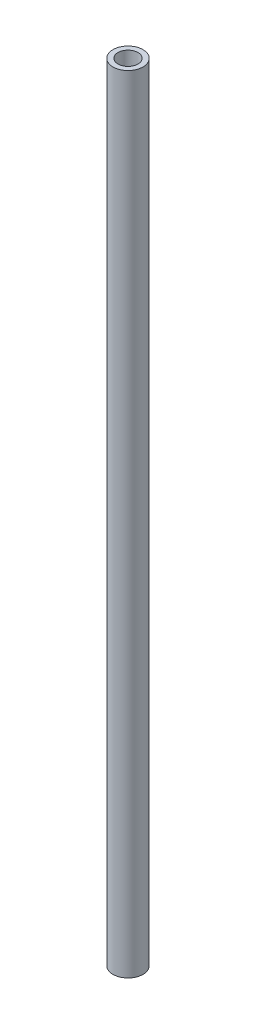
ISO-10303-21;
HEADER;
FILE_DESCRIPTION(('STEP AP214'),'2;1');
FILE_NAME('part.step','',(''),(''),'','','');
FILE_SCHEMA(('AUTOMOTIVE_DESIGN { 1 0 10303 214 1 1 1 1 }'));
ENDSEC;
DATA;
#1=APPLICATION_CONTEXT('core data for automotive mechanical design processes');
#2=APPLICATION_PROTOCOL_DEFINITION('international standard','automotive_design',2000,#1);
#3=PRODUCT_CONTEXT('',#1,'mechanical');
#4=PRODUCT('Part','Part','',(#3));
#5=PRODUCT_RELATED_PRODUCT_CATEGORY('part','',(#4));
#6=PRODUCT_DEFINITION_FORMATION('','',#4);
#7=PRODUCT_DEFINITION_CONTEXT('part definition',#1,'design');
#8=PRODUCT_DEFINITION('design','',#6,#7);
#9=PRODUCT_DEFINITION_SHAPE('','',#8);
#10=(LENGTH_UNIT() NAMED_UNIT(*) SI_UNIT(.MILLI.,.METRE.));
#11=(NAMED_UNIT(*) PLANE_ANGLE_UNIT() SI_UNIT($,.RADIAN.));
#12=(NAMED_UNIT(*) SI_UNIT($,.STERADIAN.) SOLID_ANGLE_UNIT());
#13=UNCERTAINTY_MEASURE_WITH_UNIT(LENGTH_MEASURE(1.E-05),#10,'distance_accuracy_value','');
#14=(GEOMETRIC_REPRESENTATION_CONTEXT(3) GLOBAL_UNCERTAINTY_ASSIGNED_CONTEXT((#13)) GLOBAL_UNIT_ASSIGNED_CONTEXT((#10,
#11,#12)) REPRESENTATION_CONTEXT('',''));
#15=CARTESIAN_POINT('',(0.,0.,0.));
#16=DIRECTION('',(0.,0.,1.));
#17=DIRECTION('',(1.,0.,0.));
#18=AXIS2_PLACEMENT_3D('',#15,#16,#17);
#19=CARTESIAN_POINT('',(0.,0.,0.));
#20=DIRECTION('',(0.,1.,0.));
#21=DIRECTION('',(0.,0.,1.));
#22=AXIS2_PLACEMENT_3D('',#19,#20,#21);
#23=CYLINDRICAL_SURFACE('',#22,3.00000000000001);
#24=CARTESIAN_POINT('',(0.,0.,0.));
#25=DIRECTION('',(0.,1.,0.));
#26=DIRECTION('',(0.,0.,1.));
#27=AXIS2_PLACEMENT_3D('',#24,#25,#26);
#28=CIRCLE('',#27,3.00000000000002);
#29=CARTESIAN_POINT('',(0.,0.,3.00000000000002));
#30=VERTEX_POINT('',#29);
#31=EDGE_CURVE('E10',#30,#30,#28,.T.);
#32=ORIENTED_EDGE('',*,*,#31,.T.);
#33=EDGE_LOOP('',(#32));
#34=FACE_BOUND('',#33,.T.);
#35=CARTESIAN_POINT('',(0.,157.,4.00287442081648E-13));
#36=DIRECTION('',(0.,1.,0.));
#37=DIRECTION('',(0.,0.,1.));
#38=AXIS2_PLACEMENT_3D('',#35,#36,#37);
#39=CIRCLE('',#38,3.);
#40=CARTESIAN_POINT('',(0.,157.,3.0000000000004));
#41=VERTEX_POINT('',#40);
#42=EDGE_CURVE('E53',#41,#41,#39,.T.);
#43=ORIENTED_EDGE('',*,*,#42,.F.);
#44=EDGE_LOOP('',(#43));
#45=FACE_BOUND('',#44,.T.);
#46=ADVANCED_FACE('F46',(#34,#45),#23,.T.);
#47=CARTESIAN_POINT('',(3.00000000000005,0.,0.));
#48=DIRECTION('',(0.,-1.,0.));
#49=DIRECTION('',(0.,0.,-1.));
#50=AXIS2_PLACEMENT_3D('',#47,#48,#49);
#51=PLANE('',#50);
#52=CARTESIAN_POINT('',(0.,0.,0.));
#53=DIRECTION('',(0.,1.,0.));
#54=DIRECTION('',(0.,0.,1.));
#55=AXIS2_PLACEMENT_3D('',#52,#53,#54);
#56=CIRCLE('',#55,2.);
#57=CARTESIAN_POINT('',(0.,0.,2.));
#58=VERTEX_POINT('',#57);
#59=EDGE_CURVE('E59',#58,#58,#56,.T.);
#60=ORIENTED_EDGE('',*,*,#59,.T.);
#61=EDGE_LOOP('',(#60));
#62=FACE_BOUND('',#61,.T.);
#63=ORIENTED_EDGE('',*,*,#31,.F.);
#64=EDGE_LOOP('',(#63));
#65=FACE_BOUND('',#64,.T.);
#66=ADVANCED_FACE('F74',(#62,#65),#51,.T.);
#67=CARTESIAN_POINT('',(0.,157.,4.00287442081648E-13));
#68=DIRECTION('',(0.,1.,0.));
#69=DIRECTION('',(0.,0.,1.));
#70=AXIS2_PLACEMENT_3D('',#67,#68,#69);
#71=PLANE('',#70);
#72=CARTESIAN_POINT('',(0.,157.,4.00287442081648E-13));
#73=DIRECTION('',(0.,1.,0.));
#74=DIRECTION('',(0.,0.,1.));
#75=AXIS2_PLACEMENT_3D('',#72,#73,#74);
#76=CIRCLE('',#75,2.);
#77=CARTESIAN_POINT('',(0.,157.,2.0000000000004));
#78=VERTEX_POINT('',#77);
#79=EDGE_CURVE('E64',#78,#78,#76,.T.);
#80=ORIENTED_EDGE('',*,*,#79,.F.);
#81=EDGE_LOOP('',(#80));
#82=FACE_BOUND('',#81,.T.);
#83=ORIENTED_EDGE('',*,*,#42,.T.);
#84=EDGE_LOOP('',(#83));
#85=FACE_BOUND('',#84,.T.);
#86=ADVANCED_FACE('F72',(#82,#85),#71,.T.);
#87=CARTESIAN_POINT('',(0.,0.,0.));
#88=DIRECTION('',(0.,1.,0.));
#89=DIRECTION('',(0.,0.,1.));
#90=AXIS2_PLACEMENT_3D('',#87,#88,#89);
#91=CYLINDRICAL_SURFACE('',#90,2.);
#92=ORIENTED_EDGE('',*,*,#59,.F.);
#93=EDGE_LOOP('',(#92));
#94=FACE_BOUND('',#93,.T.);
#95=ORIENTED_EDGE('',*,*,#79,.T.);
#96=EDGE_LOOP('',(#95));
#97=FACE_BOUND('',#96,.T.);
#98=ADVANCED_FACE('F70',(#94,#97),#91,.F.);
#99=CLOSED_SHELL('',(#46,#66,#86,#98));
#100=MANIFOLD_SOLID_BREP('B2',#99);
#101=ADVANCED_BREP_SHAPE_REPRESENTATION('',(#18,#100),#14);
#102=SHAPE_DEFINITION_REPRESENTATION(#9,#101);
ENDSEC;
END-ISO-10303-21;
